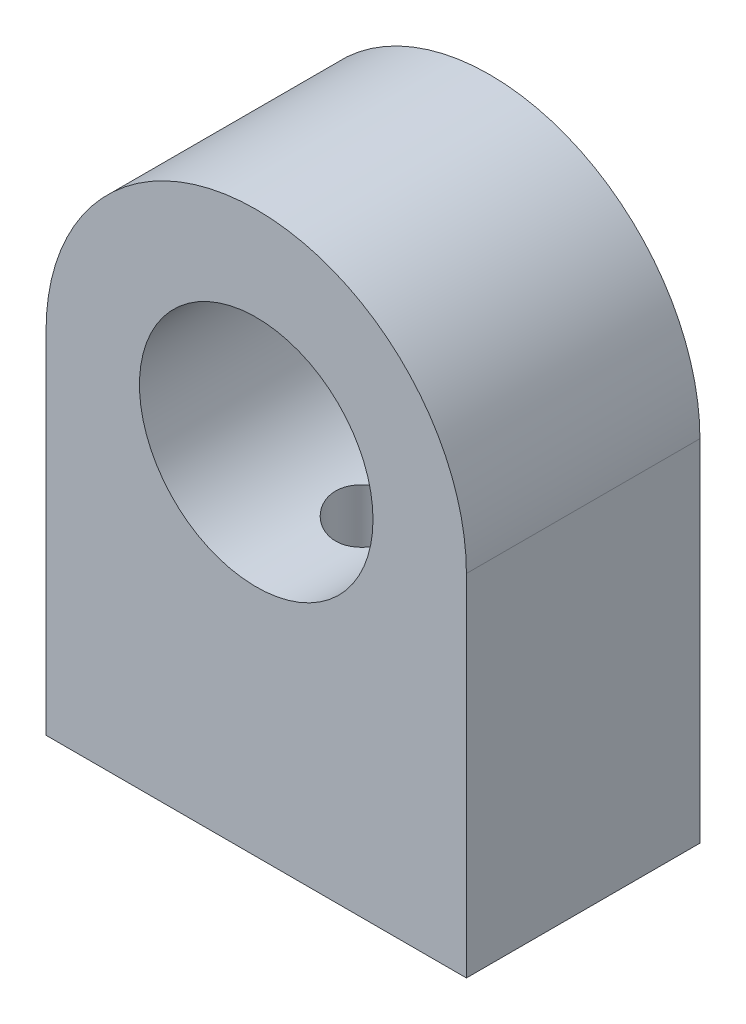
ISO-10303-21;
HEADER;
FILE_DESCRIPTION(('STEP AP214'),'2;1');
FILE_NAME('part.step','',(''),(''),'','','');
FILE_SCHEMA(('AUTOMOTIVE_DESIGN { 1 0 10303 214 1 1 1 1 }'));
ENDSEC;
DATA;
#1=APPLICATION_CONTEXT('core data for automotive mechanical design processes');
#2=APPLICATION_PROTOCOL_DEFINITION('international standard','automotive_design',2000,#1);
#3=PRODUCT_CONTEXT('',#1,'mechanical');
#4=PRODUCT('Part','Part','',(#3));
#5=PRODUCT_RELATED_PRODUCT_CATEGORY('part','',(#4));
#6=PRODUCT_DEFINITION_FORMATION('','',#4);
#7=PRODUCT_DEFINITION_CONTEXT('part definition',#1,'design');
#8=PRODUCT_DEFINITION('design','',#6,#7);
#9=PRODUCT_DEFINITION_SHAPE('','',#8);
#10=(LENGTH_UNIT() NAMED_UNIT(*) SI_UNIT(.MILLI.,.METRE.));
#11=(NAMED_UNIT(*) PLANE_ANGLE_UNIT() SI_UNIT($,.RADIAN.));
#12=(NAMED_UNIT(*) SI_UNIT($,.STERADIAN.) SOLID_ANGLE_UNIT());
#13=UNCERTAINTY_MEASURE_WITH_UNIT(LENGTH_MEASURE(1.E-05),#10,'distance_accuracy_value','');
#14=(GEOMETRIC_REPRESENTATION_CONTEXT(3) GLOBAL_UNCERTAINTY_ASSIGNED_CONTEXT((#13)) GLOBAL_UNIT_ASSIGNED_CONTEXT((#10,
#11,#12)) REPRESENTATION_CONTEXT('',''));
#15=CARTESIAN_POINT('',(0.,0.,0.));
#16=DIRECTION('',(0.,0.,1.));
#17=DIRECTION('',(1.,0.,0.));
#18=AXIS2_PLACEMENT_3D('',#15,#16,#17);
#19=CARTESIAN_POINT('',(0.,0.,6.35));
#20=DIRECTION('',(0.,0.,1.));
#21=DIRECTION('',(1.,0.,0.));
#22=AXIS2_PLACEMENT_3D('',#19,#20,#21);
#23=PLANE('',#22);
#24=CARTESIAN_POINT('',(0.,0.,6.35));
#25=DIRECTION('',(0.,0.,1.));
#26=DIRECTION('',(1.,0.,0.));
#27=AXIS2_PLACEMENT_3D('',#24,#25,#26);
#28=CIRCLE('',#27,5.715);
#29=CARTESIAN_POINT('',(5.715,0.,6.35));
#30=VERTEX_POINT('',#29);
#31=CARTESIAN_POINT('',(-5.715,0.,6.35));
#32=VERTEX_POINT('',#31);
#33=EDGE_CURVE('E98',#30,#32,#28,.T.);
#34=ORIENTED_EDGE('',*,*,#33,.T.);
#35=DIRECTION('',(0.,-1.,0.));
#36=VECTOR('',#35,1.);
#37=CARTESIAN_POINT('',(-5.715,-9.525,6.35));
#38=LINE('',#37,#36);
#39=CARTESIAN_POINT('',(-5.715,-9.525,6.35));
#40=VERTEX_POINT('',#39);
#41=EDGE_CURVE('E93',#32,#40,#38,.T.);
#42=ORIENTED_EDGE('',*,*,#41,.T.);
#43=DIRECTION('',(1.,0.,0.));
#44=VECTOR('',#43,1.);
#45=CARTESIAN_POINT('',(-5.715,-9.525,6.35));
#46=LINE('',#45,#44);
#47=CARTESIAN_POINT('',(5.715,-9.525,6.35));
#48=VERTEX_POINT('',#47);
#49=EDGE_CURVE('E96',#40,#48,#46,.T.);
#50=ORIENTED_EDGE('',*,*,#49,.T.);
#51=DIRECTION('',(0.,1.,0.));
#52=VECTOR('',#51,1.);
#53=CARTESIAN_POINT('',(5.715,-9.525,6.35));
#54=LINE('',#53,#52);
#55=EDGE_CURVE('E63',#48,#30,#54,.T.);
#56=ORIENTED_EDGE('',*,*,#55,.T.);
#57=EDGE_LOOP('',(#34,#42,#50,#56));
#58=FACE_BOUND('',#57,.T.);
#59=CARTESIAN_POINT('',(0.,0.,6.35));
#60=DIRECTION('',(0.,0.,1.));
#61=DIRECTION('',(1.,0.,0.));
#62=AXIS2_PLACEMENT_3D('',#59,#60,#61);
#63=CIRCLE('',#62,3.175);
#64=CARTESIAN_POINT('',(3.175,0.,6.35));
#65=VERTEX_POINT('',#64);
#66=EDGE_CURVE('E119',#65,#65,#63,.T.);
#67=ORIENTED_EDGE('',*,*,#66,.F.);
#68=EDGE_LOOP('',(#67));
#69=FACE_BOUND('',#68,.T.);
#70=ADVANCED_FACE('F39',(#58,#69),#23,.T.);
#71=CARTESIAN_POINT('',(0.,0.,0.));
#72=DIRECTION('',(0.,0.,1.));
#73=DIRECTION('',(1.,0.,0.));
#74=AXIS2_PLACEMENT_3D('',#71,#72,#73);
#75=PLANE('',#74);
#76=CARTESIAN_POINT('',(0.,0.,0.));
#77=DIRECTION('',(0.,0.,1.));
#78=DIRECTION('',(1.,0.,0.));
#79=AXIS2_PLACEMENT_3D('',#76,#77,#78);
#80=CIRCLE('',#79,5.715);
#81=CARTESIAN_POINT('',(5.715,0.,0.));
#82=VERTEX_POINT('',#81);
#83=CARTESIAN_POINT('',(-5.715,0.,0.));
#84=VERTEX_POINT('',#83);
#85=EDGE_CURVE('E115',#82,#84,#80,.T.);
#86=ORIENTED_EDGE('',*,*,#85,.F.);
#87=DIRECTION('',(0.,1.,0.));
#88=VECTOR('',#87,1.);
#89=CARTESIAN_POINT('',(5.715,-9.525,0.));
#90=LINE('',#89,#88);
#91=CARTESIAN_POINT('',(5.715,-9.525,0.));
#92=VERTEX_POINT('',#91);
#93=EDGE_CURVE('E86',#92,#82,#90,.T.);
#94=ORIENTED_EDGE('',*,*,#93,.F.);
#95=DIRECTION('',(1.,0.,0.));
#96=VECTOR('',#95,1.);
#97=CARTESIAN_POINT('',(-5.715,-9.525,0.));
#98=LINE('',#97,#96);
#99=CARTESIAN_POINT('',(-5.715,-9.525,0.));
#100=VERTEX_POINT('',#99);
#101=EDGE_CURVE('E80',#100,#92,#98,.T.);
#102=ORIENTED_EDGE('',*,*,#101,.F.);
#103=DIRECTION('',(0.,-1.,0.));
#104=VECTOR('',#103,1.);
#105=CARTESIAN_POINT('',(-5.715,-9.525,0.));
#106=LINE('',#105,#104);
#107=EDGE_CURVE('E103',#84,#100,#106,.T.);
#108=ORIENTED_EDGE('',*,*,#107,.F.);
#109=EDGE_LOOP('',(#86,#94,#102,#108));
#110=FACE_BOUND('',#109,.T.);
#111=CARTESIAN_POINT('',(0.,0.,0.));
#112=DIRECTION('',(0.,0.,1.));
#113=DIRECTION('',(1.,0.,0.));
#114=AXIS2_PLACEMENT_3D('',#111,#112,#113);
#115=CIRCLE('',#114,3.175);
#116=CARTESIAN_POINT('',(3.175,0.,0.));
#117=VERTEX_POINT('',#116);
#118=EDGE_CURVE('E137',#117,#117,#115,.T.);
#119=ORIENTED_EDGE('',*,*,#118,.T.);
#120=EDGE_LOOP('',(#119));
#121=FACE_BOUND('',#120,.T.);
#122=ADVANCED_FACE('F132',(#110,#121),#75,.F.);
#123=CARTESIAN_POINT('',(0.,0.,6.35));
#124=DIRECTION('',(0.,0.,-1.));
#125=DIRECTION('',(-1.,0.,0.));
#126=AXIS2_PLACEMENT_3D('',#123,#124,#125);
#127=CYLINDRICAL_SURFACE('',#126,5.715);
#128=ORIENTED_EDGE('',*,*,#85,.T.);
#129=DIRECTION('',(0.,0.,-1.));
#130=VECTOR('',#129,1.);
#131=CARTESIAN_POINT('',(-5.715,0.,6.35));
#132=LINE('',#131,#130);
#133=EDGE_CURVE('E11',#32,#84,#132,.T.);
#134=ORIENTED_EDGE('',*,*,#133,.F.);
#135=ORIENTED_EDGE('',*,*,#33,.F.);
#136=DIRECTION('',(0.,0.,-1.));
#137=VECTOR('',#136,1.);
#138=CARTESIAN_POINT('',(5.715,0.,6.35));
#139=LINE('',#138,#137);
#140=EDGE_CURVE('E111',#30,#82,#139,.T.);
#141=ORIENTED_EDGE('',*,*,#140,.T.);
#142=EDGE_LOOP('',(#128,#134,#135,#141));
#143=FACE_BOUND('',#142,.T.);
#144=ADVANCED_FACE('F41',(#143),#127,.T.);
#145=CARTESIAN_POINT('',(-5.715,-9.525,6.35));
#146=DIRECTION('',(1.,0.,0.));
#147=DIRECTION('',(0.,0.,-1.));
#148=AXIS2_PLACEMENT_3D('',#145,#146,#147);
#149=PLANE('',#148);
#150=ORIENTED_EDGE('',*,*,#107,.T.);
#151=DIRECTION('',(0.,0.,-1.));
#152=VECTOR('',#151,1.);
#153=CARTESIAN_POINT('',(-5.715,-9.525,6.35));
#154=LINE('',#153,#152);
#155=EDGE_CURVE('E55',#40,#100,#154,.T.);
#156=ORIENTED_EDGE('',*,*,#155,.F.);
#157=ORIENTED_EDGE('',*,*,#41,.F.);
#158=ORIENTED_EDGE('',*,*,#133,.T.);
#159=EDGE_LOOP('',(#150,#156,#157,#158));
#160=FACE_BOUND('',#159,.T.);
#161=ADVANCED_FACE('F102',(#160),#149,.F.);
#162=CARTESIAN_POINT('',(-5.715,-9.525,6.35));
#163=DIRECTION('',(0.,1.,0.));
#164=DIRECTION('',(0.,0.,1.));
#165=AXIS2_PLACEMENT_3D('',#162,#163,#164);
#166=PLANE('',#165);
#167=CARTESIAN_POINT('',(0.,-9.525,3.175));
#168=DIRECTION('',(0.,-1.,0.));
#169=DIRECTION('',(0.,0.,-1.));
#170=AXIS2_PLACEMENT_3D('',#167,#168,#169);
#171=CIRCLE('',#170,1.016);
#172=CARTESIAN_POINT('',(0.,-9.525,2.159));
#173=VERTEX_POINT('',#172);
#174=EDGE_CURVE('E144',#173,#173,#171,.T.);
#175=ORIENTED_EDGE('',*,*,#174,.F.);
#176=EDGE_LOOP('',(#175));
#177=FACE_BOUND('',#176,.T.);
#178=ORIENTED_EDGE('',*,*,#101,.T.);
#179=DIRECTION('',(0.,0.,-1.));
#180=VECTOR('',#179,1.);
#181=CARTESIAN_POINT('',(5.715,-9.525,6.35));
#182=LINE('',#181,#180);
#183=EDGE_CURVE('E105',#48,#92,#182,.T.);
#184=ORIENTED_EDGE('',*,*,#183,.F.);
#185=ORIENTED_EDGE('',*,*,#49,.F.);
#186=ORIENTED_EDGE('',*,*,#155,.T.);
#187=EDGE_LOOP('',(#178,#184,#185,#186));
#188=FACE_BOUND('',#187,.T.);
#189=ADVANCED_FACE('F107',(#177,#188),#166,.F.);
#190=CARTESIAN_POINT('',(5.715,-9.525,6.35));
#191=DIRECTION('',(-1.,0.,0.));
#192=DIRECTION('',(0.,0.,1.));
#193=AXIS2_PLACEMENT_3D('',#190,#191,#192);
#194=PLANE('',#193);
#195=ORIENTED_EDGE('',*,*,#93,.T.);
#196=ORIENTED_EDGE('',*,*,#140,.F.);
#197=ORIENTED_EDGE('',*,*,#55,.F.);
#198=ORIENTED_EDGE('',*,*,#183,.T.);
#199=EDGE_LOOP('',(#195,#196,#197,#198));
#200=FACE_BOUND('',#199,.T.);
#201=ADVANCED_FACE('F129',(#200),#194,.F.);
#202=CARTESIAN_POINT('',(0.,0.,6.35));
#203=DIRECTION('',(0.,0.,-1.));
#204=DIRECTION('',(-1.,0.,0.));
#205=AXIS2_PLACEMENT_3D('',#202,#203,#204);
#206=CYLINDRICAL_SURFACE('',#205,3.175);
#207=CARTESIAN_POINT('',(0.,-3.175,2.159));
#208=CARTESIAN_POINT('',(-0.0555598370106472,-3.17499986375202,2.15900015471812));
#209=CARTESIAN_POINT('',(-0.111121594532504,-3.17352796939285,2.16357237800233));
#210=CARTESIAN_POINT('',(-0.220616082285802,-3.16780076479364,2.18168970540108));
#211=CARTESIAN_POINT('',(-0.274548513242305,-3.1635449464151,2.19523644760437));
#212=CARTESIAN_POINT('',(-0.379189758377644,-3.15271393608485,2.23079622496947));
#213=CARTESIAN_POINT('',(-0.429903555599218,-3.14614243798696,2.25279578165533));
#214=CARTESIAN_POINT('',(-0.526922214410485,-3.13135582543224,2.30457808710541));
#215=CARTESIAN_POINT('',(-0.573226315460841,-3.12314042820745,2.33436217516116));
#216=CARTESIAN_POINT('',(-0.661603171199813,-3.10563938137979,2.40187741207506));
#217=CARTESIAN_POINT('',(-0.703514018576466,-3.09632958160403,2.43981420783542));
#218=CARTESIAN_POINT('',(-0.780500240451997,-3.0778263672145,2.5221203472576));
#219=CARTESIAN_POINT('',(-0.815574262890611,-3.06863297595728,2.56649096026084));
#220=CARTESIAN_POINT('',(-0.87878535871883,-3.05114204857384,2.66182656261409));
#221=CARTESIAN_POINT('',(-0.906717281748143,-3.0428741887849,2.7129335386068));
#222=CARTESIAN_POINT('',(-0.953521823804647,-3.0285350770214,2.81942688829402));
#223=CARTESIAN_POINT('',(-0.972396961560623,-3.0224632144469,2.87481206722257));
#224=CARTESIAN_POINT('',(-0.99995440287689,-3.01345677952979,2.98645745561828));
#225=CARTESIAN_POINT('',(-1.00893814497455,-3.01042968482293,3.04263558461254));
#226=CARTESIAN_POINT('',(-1.0173997499237,-3.00758117713575,3.15577702548213));
#227=CARTESIAN_POINT('',(-1.01688028204512,-3.00775886399339,3.212740112386));
#228=CARTESIAN_POINT('',(-1.00658536767602,-3.01121838128548,3.32331414640403));
#229=CARTESIAN_POINT('',(-0.997196647542802,-3.01437051068317,3.37696584793739));
#230=CARTESIAN_POINT('',(-0.970058124485782,-3.02321250478313,3.48188841620801));
#231=CARTESIAN_POINT('',(-0.952307393510228,-3.02890265116166,3.5331590179866));
#232=CARTESIAN_POINT('',(-0.908682746758457,-3.04227645393911,3.63277014035435));
#233=CARTESIAN_POINT('',(-0.882689834208638,-3.04998900713045,3.68105449966919));
#234=CARTESIAN_POINT('',(-0.823401289021329,-3.06652577486842,3.772701397322));
#235=CARTESIAN_POINT('',(-0.790103682852433,-3.07535028956233,3.81606260074215));
#236=CARTESIAN_POINT('',(-0.715267502281456,-3.09363346310088,3.89881406727009));
#237=CARTESIAN_POINT('',(-0.673410745183705,-3.10310225713194,3.93791489335615));
#238=CARTESIAN_POINT('',(-0.58361670945789,-3.12123561752947,4.00861446067837));
#239=CARTESIAN_POINT('',(-0.535678936039462,-3.12990011835404,4.04021259084574));
#240=CARTESIAN_POINT('',(-0.434506103752358,-3.14554736487811,4.09521878648294));
#241=CARTESIAN_POINT('',(-0.381229412444804,-3.15251516147943,4.11855481903113));
#242=CARTESIAN_POINT('',(-0.271231264979318,-3.16387582298625,4.15584614388082));
#243=CARTESIAN_POINT('',(-0.214510914088534,-3.16826950929944,4.16980442886362));
#244=CARTESIAN_POINT('',(-0.101690036389217,-3.17385334391851,4.18744404233241));
#245=CARTESIAN_POINT('',(-0.0456566816208413,-3.1751654821313,4.19151693674305));
#246=CARTESIAN_POINT('',(0.0663005211884462,-3.1748009612721,4.19037819642947));
#247=CARTESIAN_POINT('',(0.122224384765521,-3.17312476247662,4.18516799152823));
#248=CARTESIAN_POINT('',(0.230844736559424,-3.16705221501619,4.16592377819345));
#249=CARTESIAN_POINT('',(0.283587420173555,-3.16272854022316,4.15212535709543));
#250=CARTESIAN_POINT('',(0.385992150671359,-3.15187067107014,4.11638635738341));
#251=CARTESIAN_POINT('',(0.43565381105923,-3.1453362000399,4.09444475965771));
#252=CARTESIAN_POINT('',(0.531874046657773,-3.13052162197764,4.04242840409178));
#253=CARTESIAN_POINT('',(0.578323469018265,-3.12220182181978,4.01216335491627));
#254=CARTESIAN_POINT('',(0.665614304409052,-3.10476524232234,3.94458579065449));
#255=CARTESIAN_POINT('',(0.706454121476216,-3.0956482373761,3.90727127710035));
#256=CARTESIAN_POINT('',(0.78313484145342,-3.07716534226689,3.82481190864561));
#257=CARTESIAN_POINT('',(0.81869647967242,-3.06780491452851,3.77940553001238));
#258=CARTESIAN_POINT('',(0.881723801650584,-3.05028881367968,3.68306688172447));
#259=CARTESIAN_POINT('',(0.909189552104486,-3.0421331306447,3.632134657597));
#260=CARTESIAN_POINT('',(0.955088134918413,-3.02803726959034,3.5262543275394));
#261=CARTESIAN_POINT('',(0.973550671078872,-3.02208982177676,3.47132012421908));
#262=CARTESIAN_POINT('',(1.00089124338999,-3.01314663963254,3.35889142170256));
#263=CARTESIAN_POINT('',(1.00977315829749,-3.01014971081418,3.30139796845382));
#264=CARTESIAN_POINT('',(1.01741309922294,-3.00757544215154,3.18841375960444));
#265=CARTESIAN_POINT('',(1.01663111663476,-3.00784272197214,3.1329572778367));
#266=CARTESIAN_POINT('',(1.00608355520408,-3.01138691110433,3.0230083015689));
#267=CARTESIAN_POINT('',(0.996318434468485,-3.01466366694374,2.96851575805599));
#268=CARTESIAN_POINT('',(0.968396160842425,-3.02374644874247,2.86290802487687));
#269=CARTESIAN_POINT('',(0.950376737435621,-3.02951087789318,2.81175256870066));
#270=CARTESIAN_POINT('',(0.90656681452639,-3.04290714508447,2.71315068214785));
#271=CARTESIAN_POINT('',(0.880774680628027,-3.05053937581094,2.66570503449133));
#272=CARTESIAN_POINT('',(0.820923343592033,-3.06719918922207,2.57377588506718));
#273=CARTESIAN_POINT('',(0.78657010854048,-3.07627095597993,2.5294918531637));
#274=CARTESIAN_POINT('',(0.711081888684859,-3.09459109838529,2.44716824140387));
#275=CARTESIAN_POINT('',(0.669945054359338,-3.10383952158777,2.40913037019891));
#276=CARTESIAN_POINT('',(0.580334253539441,-3.12185753706945,2.33904898843832));
#277=CARTESIAN_POINT('',(0.531654608368092,-3.1305992244401,2.30726046555345));
#278=CARTESIAN_POINT('',(0.429363841503609,-3.14625855188176,2.25235758055827));
#279=CARTESIAN_POINT('',(0.375754432137181,-3.1531768221028,2.2292402206313));
#280=CARTESIAN_POINT('',(0.269026279094476,-3.16400396575673,2.19376765980767));
#281=CARTESIAN_POINT('',(0.216139246719455,-3.16809057326419,2.18076878387972));
#282=CARTESIAN_POINT('',(0.108835190683336,-3.17358835398787,2.16338585425595));
#283=CARTESIAN_POINT('',(0.0544185165509859,-3.17500013344915,2.15899984846013));
#284=CARTESIAN_POINT('',(0.,-3.175,2.159));
#285=B_SPLINE_CURVE_WITH_KNOTS('',3,(#207,#208,#209,#210,#211,#212,#213,#214,#215,#216,#217,
#218,#219,#220,#221,#222,#223,#224,#225,#226,#227,#228,#229,#230,#231,#232,#233,#234,#235,#236,
#237,#238,#239,#240,#241,#242,#243,#244,#245,#246,#247,#248,#249,#250,#251,#252,#253,#254,#255,
#256,#257,#258,#259,#260,#261,#262,#263,#264,#265,#266,#267,#268,#269,#270,#271,#272,#273,#274,
#275,#276,#277,#278,#279,#280,#281,#282,#283,#284),.UNSPECIFIED.,.T.,.F.,(4,2,2,2,2,2,2,2,2,2,2,
2,2,2,2,2,2,2,2,2,2,2,2,2,2,2,2,2,2,2,2,2,2,2,2,2,2,2,4),(0.,0.16647940406522,0.332989203431211,
0.499234588340937,0.665508593825864,0.83661071026245,1.0077466298445,1.18335316304908,
1.35891083101691,1.52895611149687,1.69895363024332,1.86186501738168,2.02479448938424,
2.19019244418575,2.35563514021261,2.52899725853476,2.70237349176592,2.87722609297213,
3.05202286766131,3.21977391725504,3.38749913134264,3.55081469406246,3.71415070248342,
3.88158580459977,4.0490684446766,4.22353100588693,4.39799212981693,4.57187370276629,
4.74568485254023,4.91125595701228,5.07681861843682,5.23971407521021,5.40264380852832,
5.57221235480596,5.7418272099473,5.91735091303735,6.09281387756963,6.25591040085281,
6.4189699541734),.UNSPECIFIED.);
#286=CARTESIAN_POINT('',(0.,-3.175,2.159));
#287=VERTEX_POINT('',#286);
#288=EDGE_CURVE('E43',#287,#287,#285,.T.);
#289=ORIENTED_EDGE('',*,*,#288,.F.);
#290=EDGE_LOOP('',(#289));
#291=FACE_BOUND('',#290,.T.);
#292=ORIENTED_EDGE('',*,*,#66,.T.);
#293=EDGE_LOOP('',(#292));
#294=FACE_BOUND('',#293,.T.);
#295=ORIENTED_EDGE('',*,*,#118,.F.);
#296=EDGE_LOOP('',(#295));
#297=FACE_BOUND('',#296,.T.);
#298=ADVANCED_FACE('F155',(#291,#294,#297),#206,.F.);
#299=CARTESIAN_POINT('',(0.,-0.380999999999999,3.175));
#300=DIRECTION('',(0.,-1.,0.));
#301=DIRECTION('',(0.,0.,-1.));
#302=AXIS2_PLACEMENT_3D('',#299,#300,#301);
#303=CYLINDRICAL_SURFACE('',#302,1.016);
#304=ORIENTED_EDGE('',*,*,#288,.T.);
#305=EDGE_LOOP('',(#304));
#306=FACE_BOUND('',#305,.T.);
#307=ORIENTED_EDGE('',*,*,#174,.T.);
#308=EDGE_LOOP('',(#307));
#309=FACE_BOUND('',#308,.T.);
#310=ADVANCED_FACE('F153',(#306,#309),#303,.F.);
#311=CLOSED_SHELL('',(#70,#122,#144,#161,#189,#201,#298,#310));
#312=MANIFOLD_SOLID_BREP('B2',#311);
#313=ADVANCED_BREP_SHAPE_REPRESENTATION('',(#18,#312),#14);
#314=SHAPE_DEFINITION_REPRESENTATION(#9,#313);
ENDSEC;
END-ISO-10303-21;
